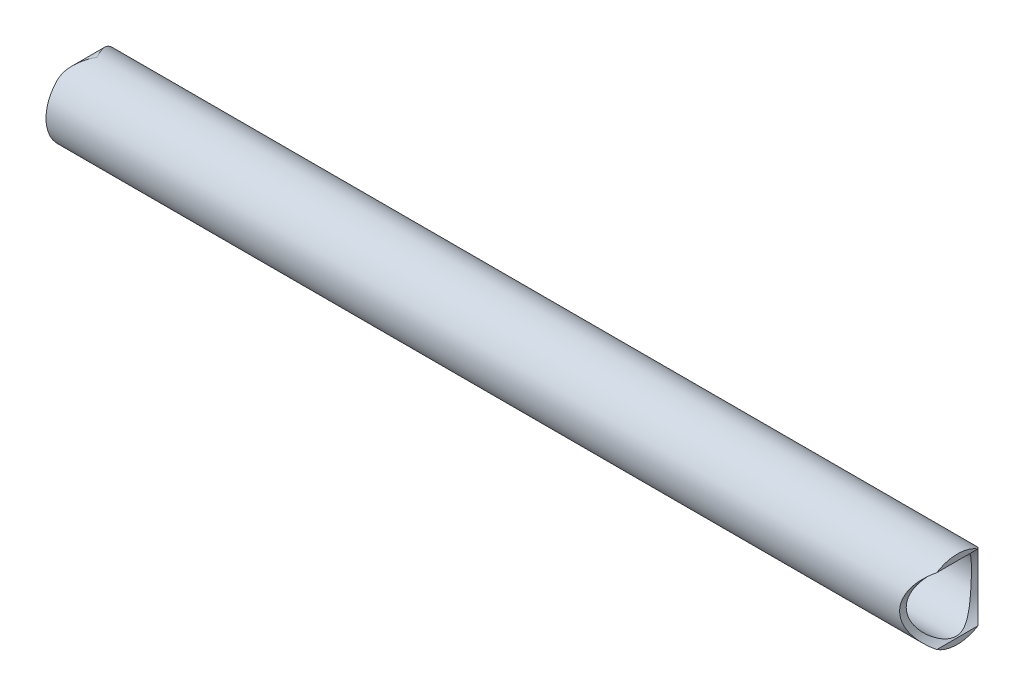
ISO-10303-21;
HEADER;
FILE_DESCRIPTION(('STEP AP214'),'2;1');
FILE_NAME('part.step','',(''),(''),'','','');
FILE_SCHEMA(('AUTOMOTIVE_DESIGN { 1 0 10303 214 1 1 1 1 }'));
ENDSEC;
DATA;
#1=APPLICATION_CONTEXT('core data for automotive mechanical design processes');
#2=APPLICATION_PROTOCOL_DEFINITION('international standard','automotive_design',2000,#1);
#3=PRODUCT_CONTEXT('',#1,'mechanical');
#4=PRODUCT('Part','Part','',(#3));
#5=PRODUCT_RELATED_PRODUCT_CATEGORY('part','',(#4));
#6=PRODUCT_DEFINITION_FORMATION('','',#4);
#7=PRODUCT_DEFINITION_CONTEXT('part definition',#1,'design');
#8=PRODUCT_DEFINITION('design','',#6,#7);
#9=PRODUCT_DEFINITION_SHAPE('','',#8);
#10=(LENGTH_UNIT() NAMED_UNIT(*) SI_UNIT(.MILLI.,.METRE.));
#11=(NAMED_UNIT(*) PLANE_ANGLE_UNIT() SI_UNIT($,.RADIAN.));
#12=(NAMED_UNIT(*) SI_UNIT($,.STERADIAN.) SOLID_ANGLE_UNIT());
#13=UNCERTAINTY_MEASURE_WITH_UNIT(LENGTH_MEASURE(1.E-05),#10,'distance_accuracy_value','');
#14=(GEOMETRIC_REPRESENTATION_CONTEXT(3) GLOBAL_UNCERTAINTY_ASSIGNED_CONTEXT((#13)) GLOBAL_UNIT_ASSIGNED_CONTEXT((#10,
#11,#12)) REPRESENTATION_CONTEXT('',''));
#15=CARTESIAN_POINT('',(0.,0.,0.));
#16=DIRECTION('',(0.,0.,1.));
#17=DIRECTION('',(1.,0.,0.));
#18=AXIS2_PLACEMENT_3D('',#15,#16,#17);
#19=CARTESIAN_POINT('',(469.10625,0.,0.));
#20=DIRECTION('',(1.,0.,0.));
#21=DIRECTION('',(0.,0.,-1.));
#22=AXIS2_PLACEMENT_3D('',#19,#20,#21);
#23=PLANE('',#22);
#24=DIRECTION('',(0.,0.,1.));
#25=VECTOR('',#24,1.);
#26=CARTESIAN_POINT('',(469.10625,17.9154421589309,-21.082));
#27=LINE('',#26,#25);
#28=CARTESIAN_POINT('',(469.10625,17.9154421589309,-11.1125));
#29=VERTEX_POINT('',#28);
#30=CARTESIAN_POINT('',(469.10625,17.915442158931,11.1125));
#31=VERTEX_POINT('',#30);
#32=EDGE_CURVE('E89',#29,#31,#27,.T.);
#33=ORIENTED_EDGE('',*,*,#32,.F.);
#34=CARTESIAN_POINT('',(469.10625,0.,0.));
#35=DIRECTION('',(1.,0.,0.));
#36=DIRECTION('',(0.,0.,-1.));
#37=AXIS2_PLACEMENT_3D('',#34,#35,#36);
#38=CIRCLE('',#37,21.082);
#39=EDGE_CURVE('E49',#29,#31,#38,.T.);
#40=ORIENTED_EDGE('',*,*,#39,.T.);
#41=EDGE_LOOP('',(#33,#40));
#42=FACE_BOUND('',#41,.T.);
#43=ADVANCED_FACE('F34',(#42),#23,.T.);
#44=DIRECTION('',(0.,0.,1.));
#45=VECTOR('',#44,1.);
#46=CARTESIAN_POINT('',(469.10625,-17.9154421589309,-21.082));
#47=LINE('',#46,#45);
#48=CARTESIAN_POINT('',(469.10625,-17.915442158931,11.1125));
#49=VERTEX_POINT('',#48);
#50=CARTESIAN_POINT('',(469.10625,-17.9154421589309,-11.1125));
#51=VERTEX_POINT('',#50);
#52=EDGE_CURVE('E86',#49,#51,#47,.F.);
#53=ORIENTED_EDGE('',*,*,#52,.F.);
#54=EDGE_CURVE('E94',#49,#51,#38,.T.);
#55=ORIENTED_EDGE('',*,*,#54,.T.);
#56=EDGE_LOOP('',(#53,#55));
#57=FACE_BOUND('',#56,.T.);
#58=ADVANCED_FACE('F93',(#57),#23,.T.);
#59=CARTESIAN_POINT('',(0.,0.,0.));
#60=DIRECTION('',(1.,0.,0.));
#61=DIRECTION('',(0.,0.,-1.));
#62=AXIS2_PLACEMENT_3D('',#59,#60,#61);
#63=PLANE('',#62);
#64=CARTESIAN_POINT('',(0.,0.,0.));
#65=DIRECTION('',(1.,0.,0.));
#66=DIRECTION('',(0.,0.,-1.));
#67=AXIS2_PLACEMENT_3D('',#64,#65,#66);
#68=CIRCLE('',#67,21.082);
#69=CARTESIAN_POINT('',(0.,14.732,15.0804144505382));
#70=VERTEX_POINT('',#69);
#71=CARTESIAN_POINT('',(0.,14.732,-15.0804144505382));
#72=VERTEX_POINT('',#71);
#73=EDGE_CURVE('E97',#70,#72,#68,.T.);
#74=ORIENTED_EDGE('',*,*,#73,.F.);
#75=DIRECTION('',(0.,0.,1.));
#76=VECTOR('',#75,1.);
#77=CARTESIAN_POINT('',(0.,14.732,-21.082));
#78=LINE('',#77,#76);
#79=CARTESIAN_POINT('',(0.,14.732,9.49362164824362));
#80=VERTEX_POINT('',#79);
#81=EDGE_CURVE('E127',#80,#70,#78,.T.);
#82=ORIENTED_EDGE('',*,*,#81,.F.);
#83=CARTESIAN_POINT('',(0.,0.,0.));
#84=DIRECTION('',(1.,0.,0.));
#85=DIRECTION('',(0.,0.,-1.));
#86=AXIS2_PLACEMENT_3D('',#83,#84,#85);
#87=CIRCLE('',#86,17.526);
#88=CARTESIAN_POINT('',(0.,14.732,-9.49362164824362));
#89=VERTEX_POINT('',#88);
#90=EDGE_CURVE('E100',#80,#89,#87,.T.);
#91=ORIENTED_EDGE('',*,*,#90,.T.);
#92=EDGE_CURVE('E63',#72,#89,#78,.T.);
#93=ORIENTED_EDGE('',*,*,#92,.F.);
#94=EDGE_LOOP('',(#74,#82,#91,#93));
#95=FACE_BOUND('',#94,.T.);
#96=ADVANCED_FACE('F140',(#95),#63,.F.);
#97=CARTESIAN_POINT('',(469.10625,0.,0.));
#98=DIRECTION('',(-1.,0.,0.));
#99=DIRECTION('',(0.,0.,1.));
#100=AXIS2_PLACEMENT_3D('',#97,#98,#99);
#101=CYLINDRICAL_SURFACE('',#100,21.082);
#102=ORIENTED_EDGE('',*,*,#73,.T.);
#103=CARTESIAN_POINT('',(0.,14.732,-15.0804144505382));
#104=CARTESIAN_POINT('',(4.99777097256306E-06,14.8585166363932,-14.9568250218965));
#105=CARTESIAN_POINT('',(0.0037804024379681,14.9834433145249,-14.8316684363902));
#106=CARTESIAN_POINT('',(0.018344612519162,15.2298802862784,-14.578499414352));
#107=CARTESIAN_POINT('',(0.0291313987626797,15.3513915529794,-14.4504878102679));
#108=CARTESIAN_POINT('',(0.0711641868780703,15.7100653220193,-14.0630095037458));
#109=CARTESIAN_POINT('',(0.112087001365868,15.9418874425845,-13.7995912481011));
#110=CARTESIAN_POINT('',(0.215488507432889,16.3879660671565,-13.2666880799684));
#111=CARTESIAN_POINT('',(0.277765297706076,16.6023646270495,-12.997281336883));
#112=CARTESIAN_POINT('',(0.420807437337394,17.0156387002352,-12.4513482602452));
#113=CARTESIAN_POINT('',(0.501584818248204,17.2145039983668,-12.1748173979638));
#114=CARTESIAN_POINT('',(0.722336490267377,17.6901137279932,-11.4788940830607));
#115=CARTESIAN_POINT('',(0.871915178025879,17.9572278098856,-11.0559422302578));
#116=CARTESIAN_POINT('',(1.19848542775072,18.4567086453977,-10.2003069203716));
#117=CARTESIAN_POINT('',(1.37548494857253,18.6890652721093,-9.76762066916));
#118=CARTESIAN_POINT('',(1.75209895067343,19.1211226362083,-8.89229878891464));
#119=CARTESIAN_POINT('',(1.9518397925665,19.3206241773796,-8.4496197349844));
#120=CARTESIAN_POINT('',(2.36824696498252,19.6862817768882,-7.55863388229215));
#121=CARTESIAN_POINT('',(2.58491234738668,19.8524397012882,-7.11032739995988));
#122=CARTESIAN_POINT('',(3.07854021979459,20.1841782782303,-6.11397748165988));
#123=CARTESIAN_POINT('',(3.35855407719812,20.3421826858222,-5.56492077807607));
#124=CARTESIAN_POINT('',(3.93195657278609,20.6121360645314,-4.46237555433802));
#125=CARTESIAN_POINT('',(4.2253492325938,20.7240710846151,-3.90888574337448));
#126=CARTESIAN_POINT('',(4.81966564824809,20.9026212412311,-2.80091191808466));
#127=CARTESIAN_POINT('',(5.12056407013035,20.9693718110366,-2.24643591433334));
#128=CARTESIAN_POINT('',(5.7263441140806,21.0587059818151,-1.13639917411688));
#129=CARTESIAN_POINT('',(6.0312234277849,21.0813141259917,-0.580839212441869));
#130=CARTESIAN_POINT('',(6.34068566822062,21.0819948744209,-0.0169715207830517));
#131=CARTESIAN_POINT('',(6.34534284661023,21.081999997751,-0.00848573804402203));
#132=CARTESIAN_POINT('',(6.35,21.082,0.));
#133=B_SPLINE_CURVE_WITH_KNOTS('',3,(#103,#104,#105,#106,#107,#108,#109,#110,#111,#112,#113,
#114,#115,#116,#117,#118,#119,#120,#121,#122,#123,#124,#125,#126,#127,#128,#129,#130,#131,#132),
.UNSPECIFIED.,.F.,.F.,(4,2,2,2,2,2,2,2,2,2,2,2,2,2,4),(0.,0.530465682198346,1.06077866603508,
2.11923257632368,3.16794284977036,4.21733708093636,5.78132496799527,7.34576765361523,
8.91937150261676,10.4928872609037,12.3996794344843,14.3070486112538,16.2086751300639,
18.1092440424708,18.1382833302831),.UNSPECIFIED.);
#134=CARTESIAN_POINT('',(6.35,21.082,0.));
#135=VERTEX_POINT('',#134);
#136=EDGE_CURVE('E126',#72,#135,#133,.T.);
#137=ORIENTED_EDGE('',*,*,#136,.T.);
#138=CARTESIAN_POINT('',(0.,14.732,15.0804144505382));
#139=CARTESIAN_POINT('',(4.99777097265902E-06,14.8585166363932,14.9568250218965));
#140=CARTESIAN_POINT('',(0.00378040243796859,14.983443314525,14.8316684363902));
#141=CARTESIAN_POINT('',(0.0183446125191639,15.2298802862785,14.5784994143519));
#142=CARTESIAN_POINT('',(0.0291313987626825,15.3513915529794,14.4504878102678));
#143=CARTESIAN_POINT('',(0.071164186878077,15.7100653220194,14.0630095037458));
#144=CARTESIAN_POINT('',(0.112087001365878,15.9418874425845,13.799591248101));
#145=CARTESIAN_POINT('',(0.215488507432905,16.3879660671565,13.2666880799683));
#146=CARTESIAN_POINT('',(0.277765297706091,16.6023646270495,12.9972813368829));
#147=CARTESIAN_POINT('',(0.420807437337405,17.0156387002352,12.4513482602451));
#148=CARTESIAN_POINT('',(0.501584818248212,17.2145039983668,12.1748173979638));
#149=CARTESIAN_POINT('',(0.722336490267378,17.6901137279932,11.4788940830607));
#150=CARTESIAN_POINT('',(0.871915178025876,17.9572278098856,11.0559422302578));
#151=CARTESIAN_POINT('',(1.19848542775071,18.4567086453976,10.2003069203717));
#152=CARTESIAN_POINT('',(1.37548494857251,18.6890652721093,9.76762066916005));
#153=CARTESIAN_POINT('',(1.75209895067341,19.1211226362082,8.89229878891469));
#154=CARTESIAN_POINT('',(1.95183979256649,19.3206241773795,8.44961973498444));
#155=CARTESIAN_POINT('',(2.36824696498251,19.6862817768881,7.55863388229216));
#156=CARTESIAN_POINT('',(2.58491234738667,19.8524397012882,7.11032739995988));
#157=CARTESIAN_POINT('',(3.0785402197946,20.1841782782303,6.11397748165988));
#158=CARTESIAN_POINT('',(3.35855407719814,20.3421826858222,5.56492077807609));
#159=CARTESIAN_POINT('',(3.93195657278606,20.6121360645314,4.462375554338));
#160=CARTESIAN_POINT('',(4.22534923259369,20.7240710846151,3.90888574337441));
#161=CARTESIAN_POINT('',(4.81966564824822,20.9026212412311,2.80091191808473));
#162=CARTESIAN_POINT('',(5.12056407013078,20.9693718110366,2.24643591433359));
#163=CARTESIAN_POINT('',(5.72634411408013,21.0587059818151,1.13639917411665));
#164=CARTESIAN_POINT('',(6.03122342778322,21.0813141259917,0.580839212440988));
#165=CARTESIAN_POINT('',(6.34068566822056,21.0819948744209,0.0169715207830728));
#166=CARTESIAN_POINT('',(6.3453428466102,21.081999997751,0.00848573804405541));
#167=CARTESIAN_POINT('',(6.35,21.082,0.));
#168=B_SPLINE_CURVE_WITH_KNOTS('',3,(#138,#139,#140,#141,#142,#143,#144,#145,#146,#147,#148,
#149,#150,#151,#152,#153,#154,#155,#156,#157,#158,#159,#160,#161,#162,#163,#164,#165,#166,#167),
.UNSPECIFIED.,.F.,.F.,(4,2,2,2,2,2,2,2,2,2,2,2,2,2,4),(0.,0.530465682198373,1.06077866603513,
2.11923257632378,3.16794284977042,4.21733708093637,5.78132496799524,7.34576765361516,
8.91937150261673,10.4928872609037,12.3996794344843,14.3070486112539,16.2086751300639,
18.1092440424708,18.1382833302831),.UNSPECIFIED.);
#169=EDGE_CURVE('E119',#135,#70,#168,.F.);
#170=ORIENTED_EDGE('',*,*,#169,.T.);
#171=EDGE_LOOP('',(#102,#137,#170));
#172=FACE_BOUND('',#171,.T.);
#173=ORIENTED_EDGE('',*,*,#39,.F.);
#174=CARTESIAN_POINT('',(480.21875,0.,0.));
#175=DIRECTION('',(-0.707106781186548,0.,0.707106781186547));
#176=DIRECTION('',(-0.707106781186548,0.,-0.707106781186547));
#177=AXIS2_PLACEMENT_3D('',#174,#175,#176);
#178=ELLIPSE('',#177,29.8144503219496,21.082);
#179=EDGE_CURVE('E96',#29,#51,#178,.T.);
#180=ORIENTED_EDGE('',*,*,#179,.T.);
#181=ORIENTED_EDGE('',*,*,#54,.F.);
#182=CARTESIAN_POINT('',(480.21875,0.,0.));
#183=DIRECTION('',(-0.707106781186548,0.,-0.707106781186547));
#184=DIRECTION('',(-0.707106781186548,0.,0.707106781186547));
#185=AXIS2_PLACEMENT_3D('',#182,#183,#184);
#186=ELLIPSE('',#185,29.8144503219496,21.082);
#187=EDGE_CURVE('E56',#49,#31,#186,.T.);
#188=ORIENTED_EDGE('',*,*,#187,.T.);
#189=EDGE_LOOP('',(#173,#180,#181,#188));
#190=FACE_BOUND('',#189,.T.);
#191=ADVANCED_FACE('F36',(#172,#190),#101,.T.);
#192=CARTESIAN_POINT('',(469.10625,0.,0.));
#193=DIRECTION('',(-1.,0.,0.));
#194=DIRECTION('',(0.,0.,1.));
#195=AXIS2_PLACEMENT_3D('',#192,#193,#194);
#196=CYLINDRICAL_SURFACE('',#195,17.526);
#197=CARTESIAN_POINT('',(459.13675,0.,17.526));
#198=CARTESIAN_POINT('',(459.136753100232,0.416555730228906,17.525996813955));
#199=CARTESIAN_POINT('',(459.149123313981,0.833163012071545,17.5111221446535));
#200=CARTESIAN_POINT('',(459.198320724751,1.66285085098589,17.4518957288154));
#201=CARTESIAN_POINT('',(459.235152005793,2.0759308074684,17.4075390599622));
#202=CARTESIAN_POINT('',(459.332452439066,2.89546158233793,17.2901260170745));
#203=CARTESIAN_POINT('',(459.392938843433,3.30190733638105,17.2170486963236));
#204=CARTESIAN_POINT('',(459.536212942405,4.10484124386305,17.0434647188049));
#205=CARTESIAN_POINT('',(459.619000210819,4.50132958743919,16.9429585862272));
#206=CARTESIAN_POINT('',(459.804608337995,5.27944797465432,16.7167963170662));
#207=CARTESIAN_POINT('',(459.907303655403,5.66115402240748,16.5912976561353));
#208=CARTESIAN_POINT('',(460.13114125938,6.41026860382347,16.3165047587702));
#209=CARTESIAN_POINT('',(460.252283245215,6.77767737045173,16.1672109102661));
#210=CARTESIAN_POINT('',(460.510997114563,7.49674702968466,15.8465909890381));
#211=CARTESIAN_POINT('',(460.648570010029,7.84840695050787,15.6752635592522));
#212=CARTESIAN_POINT('',(460.938082247339,8.53495429518089,15.3122852034019));
#213=CARTESIAN_POINT('',(461.090024633481,8.86983814178559,15.1206299696701));
#214=CARTESIAN_POINT('',(461.464140089599,9.64160099861961,14.6449374869007));
#215=CARTESIAN_POINT('',(461.691652769384,10.0709113512938,14.3527749107548));
#216=CARTESIAN_POINT('',(462.164488465582,10.8958978241818,13.7370028939555));
#217=CARTESIAN_POINT('',(462.409817485787,11.2915625079794,13.4133828401386));
#218=CARTESIAN_POINT('',(462.913798875036,12.049775776248,12.7366579401323));
#219=CARTESIAN_POINT('',(463.17248335067,12.4122381349312,12.3834806406871));
#220=CARTESIAN_POINT('',(463.697391944567,13.102805813699,11.6503545982694));
#221=CARTESIAN_POINT('',(463.963615114459,13.4309154311957,11.2704092138659));
#222=CARTESIAN_POINT('',(464.503016862729,14.0584742968281,10.4776077506457));
#223=CARTESIAN_POINT('',(464.776233749344,14.3572918160694,10.0642778803075));
#224=CARTESIAN_POINT('',(465.318313078632,14.9191165849368,9.21095532717234));
#225=CARTESIAN_POINT('',(465.587174038226,15.1821118547605,8.77095379548327));
#226=CARTESIAN_POINT('',(466.111691041438,15.6706637077535,7.86481925902692));
#227=CARTESIAN_POINT('',(466.367377460908,15.8963093356672,7.39875205622169));
#228=CARTESIAN_POINT('',(466.855669817722,16.3089147666568,6.43838077354218));
#229=CARTESIAN_POINT('',(467.088295378546,16.4959076106971,5.94410127510899));
#230=CARTESIAN_POINT('',(467.419892415188,16.7529770224336,5.15602712210236));
#231=CARTESIAN_POINT('',(467.531806838252,16.837735543251,4.872411200417));
#232=CARTESIAN_POINT('',(467.741705453925,16.9938564773723,4.29634473218566));
#233=CARTESIAN_POINT('',(467.83968784338,17.0652171570416,4.00389304799845));
#234=CARTESIAN_POINT('',(468.018453347219,17.1934754104678,3.41127303424146));
#235=CARTESIAN_POINT('',(468.099269928926,17.2504011700851,3.11112102298287));
#236=CARTESIAN_POINT('',(468.240783138788,17.3489622258268,2.503748224318));
#237=CARTESIAN_POINT('',(468.301490351692,17.3906055672393,2.19653124698383));
#238=CARTESIAN_POINT('',(468.400642338332,17.4581424184477,1.57275012439623));
#239=CARTESIAN_POINT('',(468.438798088988,17.4838316609619,1.25611705495765));
#240=CARTESIAN_POINT('',(468.489564384314,17.517930419636,0.619877416859227));
#241=CARTESIAN_POINT('',(468.502177230519,17.526341492641,0.300271118708478));
#242=CARTESIAN_POINT('',(468.501123738161,17.5256372212721,-0.338900631657943));
#243=CARTESIAN_POINT('',(468.487455708289,17.5165207489109,-0.658466079921118));
#244=CARTESIAN_POINT('',(468.434638550502,17.4810304342677,-1.29450990358539));
#245=CARTESIAN_POINT('',(468.395486264212,17.454654452937,-1.61098789140883));
#246=CARTESIAN_POINT('',(468.289324257895,17.3822895125155,-2.26597180787558));
#247=CARTESIAN_POINT('',(468.220160695607,17.3347748801548,-2.6039563959663));
#248=CARTESIAN_POINT('',(468.05798050578,17.2213863424108,-3.27094152568147));
#249=CARTESIAN_POINT('',(467.964960013026,17.1555094618906,-3.59994060193884));
#250=CARTESIAN_POINT('',(467.758998964524,17.0065131076897,-4.24855727345));
#251=CARTESIAN_POINT('',(467.64600613574,16.9233482836622,-4.56814761827544));
#252=CARTESIAN_POINT('',(467.404253660727,16.7410384013215,-5.19667563423267));
#253=CARTESIAN_POINT('',(467.275487866865,16.6418871073676,-5.50560909125264));
#254=CARTESIAN_POINT('',(466.927147015409,16.3663636741079,-6.28987340285503));
#255=CARTESIAN_POINT('',(466.698405644521,16.1786783054546,-6.75718011774374));
#256=CARTESIAN_POINT('',(466.221976191773,15.7683263145676,-7.66612047395263));
#257=CARTESIAN_POINT('',(465.974277188512,15.5456394491178,-8.10773905469757));
#258=CARTESIAN_POINT('',(465.468372952079,15.0664754392744,-8.96683638051191));
#259=CARTESIAN_POINT('',(465.21015403316,14.8099532398125,-9.38428185098054));
#260=CARTESIAN_POINT('',(464.690466965766,14.2641231324516,-10.1948087082538));
#261=CARTESIAN_POINT('',(464.428999471574,13.9748217341554,-10.5878949086503));
#262=CARTESIAN_POINT('',(463.895324879337,13.348195218157,-11.368790869149));
#263=CARTESIAN_POINT('',(463.623240901127,13.0091843032674,-11.7553355433847));
#264=CARTESIAN_POINT('',(463.087541373633,12.2951909614096,-12.5002060187878));
#265=CARTESIAN_POINT('',(462.823927094039,11.9202031744408,-12.8585276006225));
#266=CARTESIAN_POINT('',(462.311174827839,11.1350258886843,-13.5441070863272));
#267=CARTESIAN_POINT('',(462.062010084927,10.7249051788906,-13.8714231651622));
#268=CARTESIAN_POINT('',(461.7029705029,10.0834868401277,-14.3371461507588));
#269=CARTESIAN_POINT('',(461.585752726259,9.8653306424743,-14.4881649831134));
#270=CARTESIAN_POINT('',(461.356837871324,9.42027707168284,-14.7814103315513));
#271=CARTESIAN_POINT('',(461.245142151037,9.19337757252926,-14.9236346869964));
#272=CARTESIAN_POINT('',(460.973493112914,8.61498224084044,-15.2678084182525));
#273=CARTESIAN_POINT('',(460.817459068209,8.25811349099297,-15.4639027842676));
#274=CARTESIAN_POINT('',(460.521964191443,7.52616004996061,-15.8330525436508));
#275=CARTESIAN_POINT('',(460.382499423159,7.15107971509298,-16.0061134100713));
#276=CARTESIAN_POINT('',(460.122537175912,6.38410638575886,-16.3271734823368));
#277=CARTESIAN_POINT('',(460.00203301395,5.99221937735624,-16.4751815198914));
#278=CARTESIAN_POINT('',(459.782250109816,5.19343454244432,-16.7441479493523));
#279=CARTESIAN_POINT('',(459.682971726726,4.78653646212599,-16.8651058836479));
#280=CARTESIAN_POINT('',(459.507089403541,3.95712937963007,-17.0788335101842));
#281=CARTESIAN_POINT('',(459.430663185674,3.53452536865489,-17.1713824047497));
#282=CARTESIAN_POINT('',(459.30330895774,2.67986601870688,-17.325342710614));
#283=CARTESIAN_POINT('',(459.252380994275,2.24781066246181,-17.3867540650041));
#284=CARTESIAN_POINT('',(459.177324216148,1.37821649825806,-17.4771905064637));
#285=CARTESIAN_POINT('',(459.153182158585,0.940680508218323,-17.5062315973617));
#286=CARTESIAN_POINT('',(459.132290012414,0.0640313485043037,-17.5313661812511));
#287=CARTESIAN_POINT('',(459.135537074792,-0.37508165237985,-17.5274631010918));
#288=CARTESIAN_POINT('',(459.167335633984,-1.19930498558239,-17.4891990815668));
#289=CARTESIAN_POINT('',(459.192874675364,-1.58470875998572,-17.4584640327402));
#290=CARTESIAN_POINT('',(459.264684232639,-2.35069997583225,-17.3719144045829));
#291=CARTESIAN_POINT('',(459.310952802018,-2.73128786604044,-17.3161021800126));
#292=CARTESIAN_POINT('',(459.42332254399,-3.48513791526224,-17.1802563891461));
#293=CARTESIAN_POINT('',(459.489424907109,-3.85839963308743,-17.1002213688688));
#294=CARTESIAN_POINT('',(459.64024630486,-4.59536738648546,-16.9170761014037));
#295=CARTESIAN_POINT('',(459.724966273857,-4.95907294143571,-16.813964696073));
#296=CARTESIAN_POINT('',(459.913145504431,-5.68108005964255,-16.5840874699882));
#297=CARTESIAN_POINT('',(460.016895992016,-6.03918783157445,-16.4569529541794));
#298=CARTESIAN_POINT('',(460.240467917882,-6.74203119401674,-16.1817226350541));
#299=CARTESIAN_POINT('',(460.360289050715,-7.08676703852215,-16.033627230131));
#300=CARTESIAN_POINT('',(460.614268706947,-7.7617711253795,-15.7179651464271));
#301=CARTESIAN_POINT('',(460.748429245294,-8.09203732526567,-15.5503957309038));
#302=CARTESIAN_POINT('',(461.029307650088,-8.73727082208682,-15.1972398091077));
#303=CARTESIAN_POINT('',(461.176028031205,-9.05223503545283,-15.0116496938153));
#304=CARTESIAN_POINT('',(461.548812920572,-9.80464712063615,-14.5364034891831));
#305=CARTESIAN_POINT('',(461.780846995919,-10.2333578451482,-14.2375288779349));
#306=CARTESIAN_POINT('',(462.262358234905,-11.0565036944503,-13.6081978996813));
#307=CARTESIAN_POINT('',(462.511842112484,-11.4509254939542,-13.2777293585403));
#308=CARTESIAN_POINT('',(463.023748955069,-12.2062013475731,-12.5869774042746));
#309=CARTESIAN_POINT('',(463.286207884647,-12.5669530526875,-12.2266089972621));
#310=CARTESIAN_POINT('',(463.817996141297,-13.253470559835,-11.4788424530418));
#311=CARTESIAN_POINT('',(464.08732447637,-13.5792413783913,-11.091448204724));
#312=CARTESIAN_POINT('',(464.631962798302,-14.2012900820747,-10.2834169092844));
#313=CARTESIAN_POINT('',(464.907294003942,-14.4969406813881,-9.8623113113111));
#314=CARTESIAN_POINT('',(465.452322074852,-15.0517275612925,-8.99289776114401));
#315=CARTESIAN_POINT('',(465.722016777624,-15.3108500388738,-8.54457961710635));
#316=CARTESIAN_POINT('',(466.246222682617,-15.7906628138659,-7.62139093429989));
#317=CARTESIAN_POINT('',(466.500775922646,-16.0114631279653,-7.14660175430663));
#318=CARTESIAN_POINT('',(466.984149383237,-16.4132437140876,-6.16809279152978));
#319=CARTESIAN_POINT('',(467.212994501134,-16.5942626782093,-5.6644017261431));
#320=CARTESIAN_POINT('',(467.533166365567,-16.8388425611419,-4.86810478458098));
#321=CARTESIAN_POINT('',(467.63901918611,-16.9179225696371,-4.58604260557915));
#322=CARTESIAN_POINT('',(467.836250596365,-17.062806654192,-4.01353560636163));
#323=CARTESIAN_POINT('',(467.92763123726,-17.1286126119829,-3.72309198098292));
#324=CARTESIAN_POINT('',(468.092782938295,-17.2459247048064,-3.13503376582409));
#325=CARTESIAN_POINT('',(468.166590343537,-17.2974603903694,-2.83743540296246));
#326=CARTESIAN_POINT('',(468.29389080646,-17.3854671554674,-2.23575303013736));
#327=CARTESIAN_POINT('',(468.347389138256,-17.4219421463683,-1.93167072569972));
#328=CARTESIAN_POINT('',(468.432050986908,-17.4793343349965,-1.31542257105261));
#329=CARTESIAN_POINT('',(468.462959056324,-17.5000736934338,-1.00320440672016));
#330=CARTESIAN_POINT('',(468.499785417953,-17.524756770186,-0.376634351053846));
#331=CARTESIAN_POINT('',(468.505705534394,-17.5287017145648,-0.0622826171578791));
#332=CARTESIAN_POINT('',(468.492219236601,-17.519682115217,0.565765427557123));
#333=CARTESIAN_POINT('',(468.472801625762,-17.5067100959756,0.87946138722474));
#334=CARTESIAN_POINT('',(468.409708218613,-17.4642111799082,1.50326166249684));
#335=CARTESIAN_POINT('',(468.366029014212,-17.4346819572413,1.8133654672525));
#336=CARTESIAN_POINT('',(468.24947913328,-17.3549094765865,2.46783373112703));
#337=CARTESIAN_POINT('',(468.173539424602,-17.302463431889,2.81137909094881));
#338=CARTESIAN_POINT('',(467.99769360765,-17.1787080018257,3.48874159064592));
#339=CARTESIAN_POINT('',(467.897782550923,-17.1073947213456,3.82255670590954));
#340=CARTESIAN_POINT('',(467.678186596836,-16.947078987979,4.48018532937914));
#341=CARTESIAN_POINT('',(467.55845074705,-16.8580308311813,4.80397044519033));
#342=CARTESIAN_POINT('',(467.303531095877,-16.6635408359202,5.44039078400235));
#343=CARTESIAN_POINT('',(467.168341323107,-16.5580926547885,5.75302163536546));
#344=CARTESIAN_POINT('',(466.803678142386,-16.2655608949425,6.54686642927639));
#345=CARTESIAN_POINT('',(466.565311783285,-16.0668060807317,7.0197186237903));
#346=CARTESIAN_POINT('',(466.070778251224,-15.6331071713109,7.93883090279246));
#347=CARTESIAN_POINT('',(465.814601013657,-15.3981425218364,8.38507568297595));
#348=CARTESIAN_POINT('',(465.292991177891,-14.8931005076266,9.25247800104897));
#349=CARTESIAN_POINT('',(465.027546784682,-14.6229771058186,9.67360157184695));
#350=CARTESIAN_POINT('',(464.49479644847,-14.0485414814654,10.4903942108924));
#351=CARTESIAN_POINT('',(464.227490886297,-13.7442360709218,10.8860683262347));
#352=CARTESIAN_POINT('',(463.685008627962,-13.0872302237909,11.6686564771624));
#353=CARTESIAN_POINT('',(463.410011314537,-12.7329783860628,12.0543962817461));
#354=CARTESIAN_POINT('',(462.870324829164,-11.9872775461265,12.7961902436962));
#355=CARTESIAN_POINT('',(462.60563734665,-11.5958224834142,13.1522395466039));
#356=CARTESIAN_POINT('',(462.092856716602,-10.776623787392,13.8313916713883));
#357=CARTESIAN_POINT('',(461.844731277596,-10.3489546907981,14.1545592898452));
#358=CARTESIAN_POINT('',(461.489058671317,-9.6805538418048,14.6123392874479));
#359=CARTESIAN_POINT('',(461.373266967441,-9.45330032462178,14.7604208100894));
#360=CARTESIAN_POINT('',(461.147843154438,-8.98986303225831,15.0471693205303));
#361=CARTESIAN_POINT('',(461.03821252428,-8.7536771354263,15.1858340494738));
#362=CARTESIAN_POINT('',(460.777882456114,-8.16388969440334,15.5135810654738));
#363=CARTESIAN_POINT('',(460.631019615212,-7.80547285234025,15.6971201066552));
#364=CARTESIAN_POINT('',(460.354258282389,-7.07152507053722,16.0411475968501));
#365=CARTESIAN_POINT('',(460.224355748624,-6.69599823719479,16.2016415386992));
#366=CARTESIAN_POINT('',(459.983865788701,-5.92969186792639,16.4975121757086));
#367=CARTESIAN_POINT('',(459.873255954141,-5.53893068115682,16.6329180221441));
#368=CARTESIAN_POINT('',(459.673317296928,-4.74382214338575,16.8768969338328));
#369=CARTESIAN_POINT('',(459.583984673672,-4.33947723349805,16.9854747913174));
#370=CARTESIAN_POINT('',(459.445844180231,-3.61139042732534,17.1529959877094));
#371=CARTESIAN_POINT('',(459.392441530083,-3.2898093654496,17.2176086822695));
#372=CARTESIAN_POINT('',(459.300313709527,-2.64139463379433,17.3289327236608));
#373=CARTESIAN_POINT('',(459.261591366206,-2.31455996491102,17.3756406224611));
#374=CARTESIAN_POINT('',(459.199400717763,-1.657300955975,17.4505998410856));
#375=CARTESIAN_POINT('',(459.175933854947,-1.32687627951213,17.4788494157967));
#376=CARTESIAN_POINT('',(459.144609151471,-0.66431170552806,17.5165484873698));
#377=CARTESIAN_POINT('',(459.136747527795,-0.332172243283639,17.5260025406341));
#378=CARTESIAN_POINT('',(459.13675,0.,17.526));
#379=B_SPLINE_CURVE_WITH_KNOTS('',3,(#197,#198,#199,#200,#201,#202,#203,#204,#205,#206,#207,
#208,#209,#210,#211,#212,#213,#214,#215,#216,#217,#218,#219,#220,#221,#222,#223,#224,#225,#226,
#227,#228,#229,#230,#231,#232,#233,#234,#235,#236,#237,#238,#239,#240,#241,#242,#243,#244,#245,
#246,#247,#248,#249,#250,#251,#252,#253,#254,#255,#256,#257,#258,#259,#260,#261,#262,#263,#264,
#265,#266,#267,#268,#269,#270,#271,#272,#273,#274,#275,#276,#277,#278,#279,#280,#281,#282,#283,
#284,#285,#286,#287,#288,#289,#290,#291,#292,#293,#294,#295,#296,#297,#298,#299,#300,#301,#302,
#303,#304,#305,#306,#307,#308,#309,#310,#311,#312,#313,#314,#315,#316,#317,#318,#319,#320,#321,
#322,#323,#324,#325,#326,#327,#328,#329,#330,#331,#332,#333,#334,#335,#336,#337,#338,#339,#340,
#341,#342,#343,#344,#345,#346,#347,#348,#349,#350,#351,#352,#353,#354,#355,#356,#357,#358,#359,
#360,#361,#362,#363,#364,#365,#366,#367,#368,#369,#370,#371,#372,#373,#374,#375,#376,#377,#378),
.UNSPECIFIED.,.T.,.F.,(4,2,2,2,2,2,2,2,2,2,2,2,2,2,2,2,2,2,2,2,2,2,2,2,2,2,2,2,2,2,2,2,2,2,2,2,
2,2,2,2,2,2,2,2,2,2,2,2,2,2,2,2,2,2,2,2,2,2,2,2,2,2,2,2,2,2,2,2,2,2,2,2,2,2,2,2,2,2,2,2,2,2,2,2,
2,2,2,2,2,2,4),(0.,1.24931215514068,2.49883294793602,3.74926674484587,4.99967664647633,
6.24244384055415,7.48519077601582,8.72801428973392,9.97110169852848,11.6694991969452,
13.3684717049052,15.0717382323203,16.7747914316099,18.508900041403,20.2435871614538,
21.974077138334,23.7030816933734,24.6518793950268,25.6007997833557,26.5478527733324,
27.4944064783684,28.4528421356183,29.4111914294722,30.3696024000782,31.3281321733839,
32.3712679495731,33.4145728378166,34.4606499010713,35.5071359859366,37.1638893836605,
38.8216045193316,40.4815497807695,42.1411659704712,43.8844508919193,45.6279959405214,
47.3682019789461,48.238133531576,49.1082779678088,50.4151915777868,51.7217940919451,
53.0279350344375,54.3340980714494,55.6501696985348,56.9662437309291,58.2816668085292,
59.5969530576398,60.7579780281908,61.9188940006416,63.0798796712698,64.240923621771,
65.4214962902465,66.6020465231705,67.7827628635306,68.9637161565106,70.6766447530631,
72.3902360758568,74.1088773225334,75.8272717729951,77.5762157648221,79.3258188748362,
81.0703129492533,82.8131027115062,83.7469352207905,84.6806352566832,85.6123870984828,
86.5438968054863,87.4857834704328,88.4276013724583,89.3698355997799,90.3122022187916,
91.3777285366849,92.4434750028669,93.5120043575646,94.5809479956882,96.2751844313667,
97.9703861554526,99.6678303471317,101.364936859805,103.137598327809,104.910549063673,
106.679935458133,107.564410898222,108.449097758104,109.733689326203,111.01797419982,
112.300757301213,113.58331109564,114.579500372221,115.575881394522,116.57235660447,
117.568590219854),.UNSPECIFIED.);
#380=CARTESIAN_POINT('',(459.13675,0.,17.526));
#381=VERTEX_POINT('',#380);
#382=EDGE_CURVE('E39',#381,#381,#379,.T.);
#383=ORIENTED_EDGE('',*,*,#382,.F.);
#384=EDGE_LOOP('',(#383));
#385=FACE_BOUND('',#384,.T.);
#386=CARTESIAN_POINT('',(0.,14.732,-9.49362164824361));
#387=CARTESIAN_POINT('',(1.18215827092096E-05,14.8512065552147,-9.30864758850528));
#388=CARTESIAN_POINT('',(0.00335629290756961,14.966903733683,-9.12145207419103));
#389=CARTESIAN_POINT('',(0.015618373053566,15.191067778283,-8.74302268186063));
#390=CARTESIAN_POINT('',(0.024534469369689,15.2995365978256,-8.55178991342886));
#391=CARTESIAN_POINT('',(0.0468365894807759,15.5089823218411,-8.16580160022169));
#392=CARTESIAN_POINT('',(0.0602176995159619,15.6099673136364,-7.97105014964136));
#393=CARTESIAN_POINT('',(0.0904463086584942,15.8044598611726,-7.57811282719616));
#394=CARTESIAN_POINT('',(0.107294062917175,15.8979668658161,-7.3799267035169));
#395=CARTESIAN_POINT('',(0.161710749515973,16.1677428894095,-6.77922295697602));
#396=CARTESIAN_POINT('',(0.203066270989696,16.3325710230985,-6.37184299640371));
#397=CARTESIAN_POINT('',(0.28865530712156,16.6311343918077,-5.5460775193833));
#398=CARTESIAN_POINT('',(0.332889819449679,16.7648587740876,-5.12768821805969));
#399=CARTESIAN_POINT('',(0.420233364203613,17.0075279308424,-4.25683335736751));
#400=CARTESIAN_POINT('',(0.463124929061231,17.1145638855675,-3.80380674958994));
#401=CARTESIAN_POINT('',(0.519476718498732,17.2479052083383,-3.11843895481312));
#402=CARTESIAN_POINT('',(0.536930761583319,17.2878189125596,-2.88899376313145));
#403=CARTESIAN_POINT('',(0.568518618471742,17.3584967782642,-2.42847866805183));
#404=CARTESIAN_POINT('',(0.582652788803805,17.3892619223255,-2.19740894186361));
#405=CARTESIAN_POINT('',(0.60700831203503,17.4414967310561,-1.73463327297525));
#406=CARTESIAN_POINT('',(0.617239840917754,17.4629905896764,-1.50293059363321));
#407=CARTESIAN_POINT('',(0.633438941414769,17.4967389939057,-1.03872466306625));
#408=CARTESIAN_POINT('',(0.639406934130212,17.5089944519799,-0.806221493184098));
#409=CARTESIAN_POINT('',(0.646841906691908,17.5242321079992,-0.340835958369956));
#410=CARTESIAN_POINT('',(0.648308834845186,17.5272141994432,-0.107953589113738));
#411=CARTESIAN_POINT('',(0.646683444701061,17.5238958672413,0.357727673351307));
#412=CARTESIAN_POINT('',(0.64359113409545,17.5175954592557,0.590526566700303));
#413=CARTESIAN_POINT('',(0.633015011982841,17.4958254842557,1.05357258230511));
#414=CARTESIAN_POINT('',(0.625569519654457,17.4804359133699,1.28382432502859));
#415=CARTESIAN_POINT('',(0.606616305295421,17.4405997328694,1.74338121783046));
#416=CARTESIAN_POINT('',(0.595108185917324,17.416152237328,1.97268627309738));
#417=CARTESIAN_POINT('',(0.555116369049375,17.3293085585805,2.65858155894497));
#418=CARTESIAN_POINT('',(0.521163416818214,17.2534079290171,3.11322070575031));
#419=CARTESIAN_POINT('',(0.443683996229778,17.0661243267718,4.01506176899039));
#420=CARTESIAN_POINT('',(0.400139881988926,16.9546757811965,4.4622483212256));
#421=CARTESIAN_POINT('',(0.31015365623528,16.6970370744889,5.34616265629826));
#422=CARTESIAN_POINT('',(0.263712022198695,16.5508526263209,5.78289214600579));
#423=CARTESIAN_POINT('',(0.190296116221632,16.2789916862365,6.49992819615105));
#424=CARTESIAN_POINT('',(0.162003200675152,16.1627907207943,6.78372963515089));
#425=CARTESIAN_POINT('',(0.109990072823221,15.9155254057193,7.34511810644267));
#426=CARTESIAN_POINT('',(0.0862682339282398,15.7844663697057,7.62270731812361));
#427=CARTESIAN_POINT('',(0.0460592939801918,15.5080873202831,8.17029076843601));
#428=CARTESIAN_POINT('',(0.0295522145321793,15.3628080690132,8.44030401764001));
#429=CARTESIAN_POINT('',(0.00654051357353983,15.0579847067746,8.9728539714487));
#430=CARTESIAN_POINT('',(4.36685221627461E-05,14.898429607302,9.23538470802819));
#431=CARTESIAN_POINT('',(0.,14.732,9.49362164824361));
#432=B_SPLINE_CURVE_WITH_KNOTS('',3,(#386,#387,#388,#389,#390,#391,#392,#393,#394,#395,#396,
#397,#398,#399,#400,#401,#402,#403,#404,#405,#406,#407,#408,#409,#410,#411,#412,#413,#414,#415,
#416,#417,#418,#419,#420,#421,#422,#423,#424,#425,#426,#427,#428,#429,#430,#431),.UNSPECIFIED.,
.F.,.F.,(4,2,2,2,2,2,2,2,2,2,2,2,2,2,2,2,2,2,2,2,2,2,4),(0.,0.660061225427474,1.31994334467436,
1.97910164384406,2.6383084756313,3.96109639181251,5.2843451659066,6.68505552254074,
7.38551890925716,8.08590703728532,8.78445623939876,9.48293643762741,10.1814246575994,
10.8799116991686,11.5723409064333,12.2648378558842,13.6496257450175,15.0369829791431,
16.4241121943468,17.3476269451524,18.2708124595747,19.1914251291658,20.1127526175606),.UNSPECIFIED.);
#433=EDGE_CURVE('E11',#89,#80,#432,.T.);
#434=ORIENTED_EDGE('',*,*,#433,.F.);
#435=ORIENTED_EDGE('',*,*,#90,.F.);
#436=EDGE_LOOP('',(#434,#435));
#437=FACE_BOUND('',#436,.T.);
#438=ADVANCED_FACE('F109',(#385,#437),#196,.F.);
#439=CARTESIAN_POINT('',(6.35,14.732,-21.082));
#440=DIRECTION('',(0.,0.,1.));
#441=DIRECTION('',(1.,0.,0.));
#442=AXIS2_PLACEMENT_3D('',#439,#440,#441);
#443=CYLINDRICAL_SURFACE('',#442,6.35);
#444=ORIENTED_EDGE('',*,*,#92,.T.);
#445=ORIENTED_EDGE('',*,*,#433,.T.);
#446=ORIENTED_EDGE('',*,*,#81,.T.);
#447=ORIENTED_EDGE('',*,*,#169,.F.);
#448=ORIENTED_EDGE('',*,*,#136,.F.);
#449=EDGE_LOOP('',(#444,#445,#446,#447,#448));
#450=FACE_BOUND('',#449,.T.);
#451=ADVANCED_FACE('F112',(#450),#443,.T.);
#452=CARTESIAN_POINT('',(480.21875,0.,-21.082));
#453=DIRECTION('',(0.,0.,1.));
#454=DIRECTION('',(1.,0.,0.));
#455=AXIS2_PLACEMENT_3D('',#452,#453,#454);
#456=CYLINDRICAL_SURFACE('',#455,21.082);
#457=ORIENTED_EDGE('',*,*,#382,.T.);
#458=EDGE_LOOP('',(#457));
#459=FACE_BOUND('',#458,.T.);
#460=ORIENTED_EDGE('',*,*,#32,.T.);
#461=ORIENTED_EDGE('',*,*,#187,.F.);
#462=ORIENTED_EDGE('',*,*,#52,.T.);
#463=ORIENTED_EDGE('',*,*,#179,.F.);
#464=EDGE_LOOP('',(#460,#461,#462,#463));
#465=FACE_BOUND('',#464,.T.);
#466=ADVANCED_FACE('F85',(#459,#465),#456,.F.);
#467=CLOSED_SHELL('',(#43,#58,#96,#191,#438,#451,#466));
#468=MANIFOLD_SOLID_BREP('B2',#467);
#469=ADVANCED_BREP_SHAPE_REPRESENTATION('',(#18,#468),#14);
#470=SHAPE_DEFINITION_REPRESENTATION(#9,#469);
ENDSEC;
END-ISO-10303-21;
